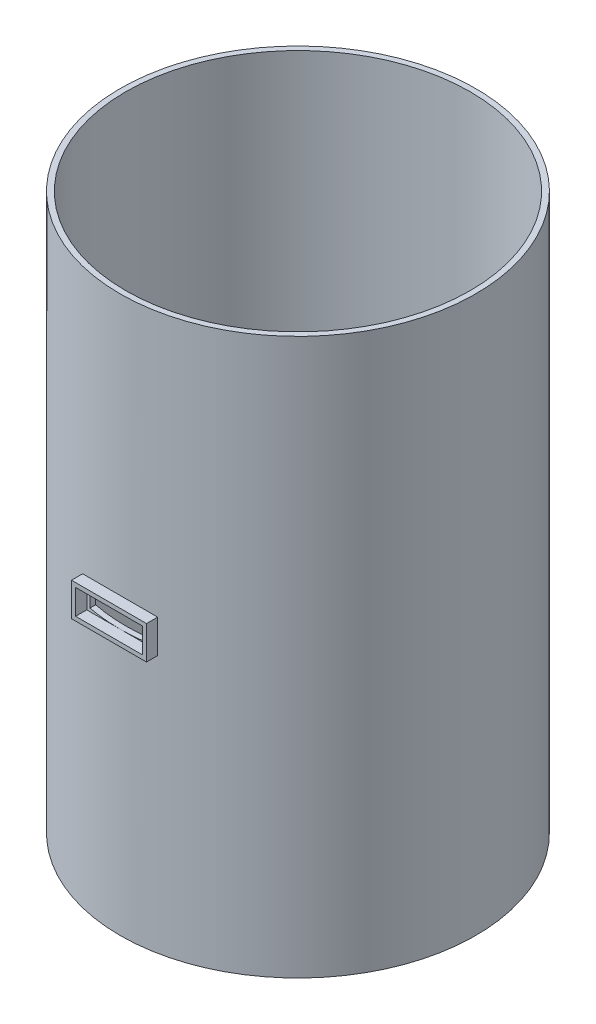
ISO-10303-21;
HEADER;
FILE_DESCRIPTION(('STEP AP214'),'2;1');
FILE_NAME('part.step','',(''),(''),'','','');
FILE_SCHEMA(('AUTOMOTIVE_DESIGN { 1 0 10303 214 1 1 1 1 }'));
ENDSEC;
DATA;
#1=APPLICATION_CONTEXT('core data for automotive mechanical design processes');
#2=APPLICATION_PROTOCOL_DEFINITION('international standard','automotive_design',2000,#1);
#3=PRODUCT_CONTEXT('',#1,'mechanical');
#4=PRODUCT('Part','Part','',(#3));
#5=PRODUCT_RELATED_PRODUCT_CATEGORY('part','',(#4));
#6=PRODUCT_DEFINITION_FORMATION('','',#4);
#7=PRODUCT_DEFINITION_CONTEXT('part definition',#1,'design');
#8=PRODUCT_DEFINITION('design','',#6,#7);
#9=PRODUCT_DEFINITION_SHAPE('','',#8);
#10=(LENGTH_UNIT() NAMED_UNIT(*) SI_UNIT(.MILLI.,.METRE.));
#11=(NAMED_UNIT(*) PLANE_ANGLE_UNIT() SI_UNIT($,.RADIAN.));
#12=(NAMED_UNIT(*) SI_UNIT($,.STERADIAN.) SOLID_ANGLE_UNIT());
#13=UNCERTAINTY_MEASURE_WITH_UNIT(LENGTH_MEASURE(1.E-05),#10,'distance_accuracy_value','');
#14=(GEOMETRIC_REPRESENTATION_CONTEXT(3) GLOBAL_UNCERTAINTY_ASSIGNED_CONTEXT((#13)) GLOBAL_UNIT_ASSIGNED_CONTEXT((#10,
#11,#12)) REPRESENTATION_CONTEXT('',''));
#15=CARTESIAN_POINT('',(0.,0.,0.));
#16=DIRECTION('',(0.,0.,1.));
#17=DIRECTION('',(1.,0.,0.));
#18=AXIS2_PLACEMENT_3D('',#15,#16,#17);
#19=CARTESIAN_POINT('',(0.,0.,34.));
#20=DIRECTION('',(0.,0.,1.));
#21=DIRECTION('',(1.,0.,0.));
#22=AXIS2_PLACEMENT_3D('',#19,#20,#21);
#23=PLANE('',#22);
#24=DIRECTION('',(0.,-1.,0.));
#25=VECTOR('',#24,1.);
#26=CARTESIAN_POINT('',(-6.75000000000002,53.,34.));
#27=LINE('',#26,#25);
#28=CARTESIAN_POINT('',(-6.75000000000002,53.,34.));
#29=VERTEX_POINT('',#28);
#30=CARTESIAN_POINT('',(-6.75000000000002,47.,34.));
#31=VERTEX_POINT('',#30);
#32=EDGE_CURVE('E181',#29,#31,#27,.T.);
#33=ORIENTED_EDGE('',*,*,#32,.T.);
#34=DIRECTION('',(1.,0.,0.));
#35=VECTOR('',#34,1.);
#36=CARTESIAN_POINT('',(-6.75000000000002,47.,34.));
#37=LINE('',#36,#35);
#38=CARTESIAN_POINT('',(6.74999999999998,47.,34.));
#39=VERTEX_POINT('',#38);
#40=EDGE_CURVE('E184',#31,#39,#37,.T.);
#41=ORIENTED_EDGE('',*,*,#40,.T.);
#42=DIRECTION('',(0.,-1.,0.));
#43=VECTOR('',#42,1.);
#44=CARTESIAN_POINT('',(6.74999999999998,53.,34.));
#45=LINE('',#44,#43);
#46=CARTESIAN_POINT('',(6.74999999999998,53.,34.));
#47=VERTEX_POINT('',#46);
#48=EDGE_CURVE('E187',#47,#39,#45,.T.);
#49=ORIENTED_EDGE('',*,*,#48,.F.);
#50=DIRECTION('',(1.,0.,0.));
#51=VECTOR('',#50,1.);
#52=CARTESIAN_POINT('',(-6.75000000000002,53.,34.));
#53=LINE('',#52,#51);
#54=EDGE_CURVE('E190',#29,#47,#53,.T.);
#55=ORIENTED_EDGE('',*,*,#54,.F.);
#56=EDGE_LOOP('',(#33,#41,#49,#55));
#57=FACE_BOUND('',#56,.T.);
#58=DIRECTION('',(1.,0.,0.));
#59=VECTOR('',#58,1.);
#60=CARTESIAN_POINT('',(-6.00000000000001,47.75,34.));
#61=LINE('',#60,#59);
#62=CARTESIAN_POINT('',(-6.00000000000001,47.75,34.));
#63=VERTEX_POINT('',#62);
#64=CARTESIAN_POINT('',(5.99999999999999,47.75,34.));
#65=VERTEX_POINT('',#64);
#66=EDGE_CURVE('E155',#63,#65,#61,.T.);
#67=ORIENTED_EDGE('',*,*,#66,.F.);
#68=DIRECTION('',(0.,-1.,0.));
#69=VECTOR('',#68,1.);
#70=CARTESIAN_POINT('',(-6.00000000000001,52.25,34.));
#71=LINE('',#70,#69);
#72=CARTESIAN_POINT('',(-6.00000000000001,52.25,34.));
#73=VERTEX_POINT('',#72);
#74=EDGE_CURVE('E146',#73,#63,#71,.T.);
#75=ORIENTED_EDGE('',*,*,#74,.F.);
#76=DIRECTION('',(1.,0.,0.));
#77=VECTOR('',#76,1.);
#78=CARTESIAN_POINT('',(-6.00000000000001,52.25,34.));
#79=LINE('',#78,#77);
#80=CARTESIAN_POINT('',(5.99999999999999,52.25,34.));
#81=VERTEX_POINT('',#80);
#82=EDGE_CURVE('E166',#73,#81,#79,.T.);
#83=ORIENTED_EDGE('',*,*,#82,.T.);
#84=DIRECTION('',(0.,-1.,0.));
#85=VECTOR('',#84,1.);
#86=CARTESIAN_POINT('',(5.99999999999999,52.25,34.));
#87=LINE('',#86,#85);
#88=EDGE_CURVE('E96',#81,#65,#87,.T.);
#89=ORIENTED_EDGE('',*,*,#88,.T.);
#90=EDGE_LOOP('',(#67,#75,#83,#89));
#91=FACE_BOUND('',#90,.T.);
#92=ADVANCED_FACE('F81',(#57,#91),#23,.T.);
#93=CARTESIAN_POINT('',(0.,0.,32.));
#94=DIRECTION('',(0.,0.,1.));
#95=DIRECTION('',(1.,0.,0.));
#96=AXIS2_PLACEMENT_3D('',#93,#94,#95);
#97=PLANE('',#96);
#98=DIRECTION('',(0.,-1.,0.));
#99=VECTOR('',#98,1.);
#100=CARTESIAN_POINT('',(-6.75000000000002,53.,32.));
#101=LINE('',#100,#99);
#102=CARTESIAN_POINT('',(-6.75000000000002,53.,32.));
#103=VERTEX_POINT('',#102);
#104=CARTESIAN_POINT('',(-6.75000000000002,47.,32.));
#105=VERTEX_POINT('',#104);
#106=EDGE_CURVE('E162',#103,#105,#101,.T.);
#107=ORIENTED_EDGE('',*,*,#106,.F.);
#108=DIRECTION('',(1.,0.,0.));
#109=VECTOR('',#108,1.);
#110=CARTESIAN_POINT('',(-6.75000000000002,53.,32.));
#111=LINE('',#110,#109);
#112=CARTESIAN_POINT('',(6.74999999999998,53.,32.));
#113=VERTEX_POINT('',#112);
#114=EDGE_CURVE('E185',#103,#113,#111,.T.);
#115=ORIENTED_EDGE('',*,*,#114,.T.);
#116=DIRECTION('',(0.,-1.,0.));
#117=VECTOR('',#116,1.);
#118=CARTESIAN_POINT('',(6.74999999999998,53.,32.));
#119=LINE('',#118,#117);
#120=CARTESIAN_POINT('',(6.74999999999998,47.,32.));
#121=VERTEX_POINT('',#120);
#122=EDGE_CURVE('E199',#113,#121,#119,.T.);
#123=ORIENTED_EDGE('',*,*,#122,.T.);
#124=DIRECTION('',(1.,0.,0.));
#125=VECTOR('',#124,1.);
#126=CARTESIAN_POINT('',(-6.75000000000002,47.,32.));
#127=LINE('',#126,#125);
#128=EDGE_CURVE('E196',#105,#121,#127,.T.);
#129=ORIENTED_EDGE('',*,*,#128,.F.);
#130=EDGE_LOOP('',(#107,#115,#123,#129));
#131=FACE_BOUND('',#130,.T.);
#132=DIRECTION('',(0.,-1.,0.));
#133=VECTOR('',#132,1.);
#134=CARTESIAN_POINT('',(-6.00000000000001,52.25,32.));
#135=LINE('',#134,#133);
#136=CARTESIAN_POINT('',(-6.00000000000001,52.25,32.));
#137=VERTEX_POINT('',#136);
#138=CARTESIAN_POINT('',(-6.00000000000001,47.75,32.));
#139=VERTEX_POINT('',#138);
#140=EDGE_CURVE('E104',#137,#139,#135,.T.);
#141=ORIENTED_EDGE('',*,*,#140,.T.);
#142=DIRECTION('',(1.,0.,0.));
#143=VECTOR('',#142,1.);
#144=CARTESIAN_POINT('',(-6.00000000000001,47.75,32.));
#145=LINE('',#144,#143);
#146=CARTESIAN_POINT('',(5.99999999999999,47.75,32.));
#147=VERTEX_POINT('',#146);
#148=EDGE_CURVE('E161',#139,#147,#145,.T.);
#149=ORIENTED_EDGE('',*,*,#148,.T.);
#150=DIRECTION('',(0.,-1.,0.));
#151=VECTOR('',#150,1.);
#152=CARTESIAN_POINT('',(5.99999999999999,52.25,32.));
#153=LINE('',#152,#151);
#154=CARTESIAN_POINT('',(5.99999999999999,52.25,32.));
#155=VERTEX_POINT('',#154);
#156=EDGE_CURVE('E172',#155,#147,#153,.T.);
#157=ORIENTED_EDGE('',*,*,#156,.F.);
#158=DIRECTION('',(1.,0.,0.));
#159=VECTOR('',#158,1.);
#160=CARTESIAN_POINT('',(-6.00000000000001,52.25,32.));
#161=LINE('',#160,#159);
#162=EDGE_CURVE('E156',#137,#155,#161,.T.);
#163=ORIENTED_EDGE('',*,*,#162,.F.);
#164=EDGE_LOOP('',(#141,#149,#157,#163));
#165=FACE_BOUND('',#164,.T.);
#166=ADVANCED_FACE('F216',(#131,#165),#97,.F.);
#167=CARTESIAN_POINT('',(-6.75000000000002,53.,34.));
#168=DIRECTION('',(1.,0.,0.));
#169=DIRECTION('',(0.,0.,-1.));
#170=AXIS2_PLACEMENT_3D('',#167,#168,#169);
#171=PLANE('',#170);
#172=ORIENTED_EDGE('',*,*,#106,.T.);
#173=DIRECTION('',(0.,0.,-1.));
#174=VECTOR('',#173,1.);
#175=CARTESIAN_POINT('',(-6.75000000000002,47.,34.));
#176=LINE('',#175,#174);
#177=EDGE_CURVE('E13',#31,#105,#176,.T.);
#178=ORIENTED_EDGE('',*,*,#177,.F.);
#179=ORIENTED_EDGE('',*,*,#32,.F.);
#180=DIRECTION('',(0.,0.,-1.));
#181=VECTOR('',#180,1.);
#182=CARTESIAN_POINT('',(-6.75000000000002,53.,34.));
#183=LINE('',#182,#181);
#184=EDGE_CURVE('E193',#29,#103,#183,.T.);
#185=ORIENTED_EDGE('',*,*,#184,.T.);
#186=EDGE_LOOP('',(#172,#178,#179,#185));
#187=FACE_BOUND('',#186,.T.);
#188=ADVANCED_FACE('F83',(#187),#171,.F.);
#189=CARTESIAN_POINT('',(-6.75000000000002,47.,34.));
#190=DIRECTION('',(0.,1.,0.));
#191=DIRECTION('',(0.,0.,1.));
#192=AXIS2_PLACEMENT_3D('',#189,#190,#191);
#193=PLANE('',#192);
#194=ORIENTED_EDGE('',*,*,#128,.T.);
#195=DIRECTION('',(0.,0.,-1.));
#196=VECTOR('',#195,1.);
#197=CARTESIAN_POINT('',(6.74999999999998,47.,34.));
#198=LINE('',#197,#196);
#199=EDGE_CURVE('E89',#39,#121,#198,.T.);
#200=ORIENTED_EDGE('',*,*,#199,.F.);
#201=ORIENTED_EDGE('',*,*,#40,.F.);
#202=ORIENTED_EDGE('',*,*,#177,.T.);
#203=EDGE_LOOP('',(#194,#200,#201,#202));
#204=FACE_BOUND('',#203,.T.);
#205=ADVANCED_FACE('F212',(#204),#193,.F.);
#206=CARTESIAN_POINT('',(6.74999999999998,53.,34.));
#207=DIRECTION('',(1.,0.,0.));
#208=DIRECTION('',(0.,0.,-1.));
#209=AXIS2_PLACEMENT_3D('',#206,#207,#208);
#210=PLANE('',#209);
#211=ORIENTED_EDGE('',*,*,#122,.F.);
#212=DIRECTION('',(0.,0.,-1.));
#213=VECTOR('',#212,1.);
#214=CARTESIAN_POINT('',(6.74999999999998,53.,34.));
#215=LINE('',#214,#213);
#216=EDGE_CURVE('E205',#47,#113,#215,.T.);
#217=ORIENTED_EDGE('',*,*,#216,.F.);
#218=ORIENTED_EDGE('',*,*,#48,.T.);
#219=ORIENTED_EDGE('',*,*,#199,.T.);
#220=EDGE_LOOP('',(#211,#217,#218,#219));
#221=FACE_BOUND('',#220,.T.);
#222=ADVANCED_FACE('F209',(#221),#210,.T.);
#223=CARTESIAN_POINT('',(-6.75000000000002,53.,34.));
#224=DIRECTION('',(0.,1.,0.));
#225=DIRECTION('',(0.,0.,1.));
#226=AXIS2_PLACEMENT_3D('',#223,#224,#225);
#227=PLANE('',#226);
#228=ORIENTED_EDGE('',*,*,#114,.F.);
#229=ORIENTED_EDGE('',*,*,#184,.F.);
#230=ORIENTED_EDGE('',*,*,#54,.T.);
#231=ORIENTED_EDGE('',*,*,#216,.T.);
#232=EDGE_LOOP('',(#228,#229,#230,#231));
#233=FACE_BOUND('',#232,.T.);
#234=ADVANCED_FACE('F220',(#233),#227,.T.);
#235=CARTESIAN_POINT('',(-6.00000000000001,52.25,34.));
#236=DIRECTION('',(1.,0.,0.));
#237=DIRECTION('',(0.,0.,-1.));
#238=AXIS2_PLACEMENT_3D('',#235,#236,#237);
#239=PLANE('',#238);
#240=ORIENTED_EDGE('',*,*,#140,.F.);
#241=DIRECTION('',(0.,0.,-1.));
#242=VECTOR('',#241,1.);
#243=CARTESIAN_POINT('',(-6.00000000000001,52.25,34.));
#244=LINE('',#243,#242);
#245=EDGE_CURVE('E150',#73,#137,#244,.T.);
#246=ORIENTED_EDGE('',*,*,#245,.F.);
#247=ORIENTED_EDGE('',*,*,#74,.T.);
#248=DIRECTION('',(0.,0.,-1.));
#249=VECTOR('',#248,1.);
#250=CARTESIAN_POINT('',(-6.00000000000001,47.75,34.));
#251=LINE('',#250,#249);
#252=EDGE_CURVE('E149',#63,#139,#251,.T.);
#253=ORIENTED_EDGE('',*,*,#252,.T.);
#254=EDGE_LOOP('',(#240,#246,#247,#253));
#255=FACE_BOUND('',#254,.T.);
#256=ADVANCED_FACE('F148',(#255),#239,.T.);
#257=CARTESIAN_POINT('',(-6.00000000000001,47.75,34.));
#258=DIRECTION('',(0.,1.,0.));
#259=DIRECTION('',(0.,0.,1.));
#260=AXIS2_PLACEMENT_3D('',#257,#258,#259);
#261=PLANE('',#260);
#262=ORIENTED_EDGE('',*,*,#148,.F.);
#263=ORIENTED_EDGE('',*,*,#252,.F.);
#264=ORIENTED_EDGE('',*,*,#66,.T.);
#265=DIRECTION('',(0.,0.,-1.));
#266=VECTOR('',#265,1.);
#267=CARTESIAN_POINT('',(5.99999999999999,47.75,34.));
#268=LINE('',#267,#266);
#269=EDGE_CURVE('E163',#65,#147,#268,.T.);
#270=ORIENTED_EDGE('',*,*,#269,.T.);
#271=EDGE_LOOP('',(#262,#263,#264,#270));
#272=FACE_BOUND('',#271,.T.);
#273=ADVANCED_FACE('F159',(#272),#261,.T.);
#274=CARTESIAN_POINT('',(5.99999999999999,52.25,34.));
#275=DIRECTION('',(1.,0.,0.));
#276=DIRECTION('',(0.,1.,0.));
#277=AXIS2_PLACEMENT_3D('',#274,#275,#276);
#278=PLANE('',#277);
#279=ORIENTED_EDGE('',*,*,#156,.T.);
#280=ORIENTED_EDGE('',*,*,#269,.F.);
#281=ORIENTED_EDGE('',*,*,#88,.F.);
#282=DIRECTION('',(0.,0.,-1.));
#283=VECTOR('',#282,1.);
#284=CARTESIAN_POINT('',(5.99999999999999,52.25,34.));
#285=LINE('',#284,#283);
#286=EDGE_CURVE('E178',#81,#155,#285,.T.);
#287=ORIENTED_EDGE('',*,*,#286,.T.);
#288=EDGE_LOOP('',(#279,#280,#281,#287));
#289=FACE_BOUND('',#288,.T.);
#290=ADVANCED_FACE('F261',(#289),#278,.F.);
#291=CARTESIAN_POINT('',(-6.00000000000001,52.25,34.));
#292=DIRECTION('',(0.,1.,0.));
#293=DIRECTION('',(0.,0.,1.));
#294=AXIS2_PLACEMENT_3D('',#291,#292,#293);
#295=PLANE('',#294);
#296=ORIENTED_EDGE('',*,*,#162,.T.);
#297=ORIENTED_EDGE('',*,*,#286,.F.);
#298=ORIENTED_EDGE('',*,*,#82,.F.);
#299=ORIENTED_EDGE('',*,*,#245,.T.);
#300=EDGE_LOOP('',(#296,#297,#298,#299));
#301=FACE_BOUND('',#300,.T.);
#302=ADVANCED_FACE('F267',(#301),#295,.F.);
#303=CLOSED_SHELL('',(#92,#166,#188,#205,#222,#234,#256,#273,#290,#302));
#304=MANIFOLD_SOLID_BREP('B2',#303);
#305=CARTESIAN_POINT('',(0.,100.,0.));
#306=DIRECTION('',(0.,-1.,0.));
#307=DIRECTION('',(0.,0.,-1.));
#308=AXIS2_PLACEMENT_3D('',#305,#306,#307);
#309=CYLINDRICAL_SURFACE('',#308,32.);
#310=CARTESIAN_POINT('',(0.,0.,0.));
#311=DIRECTION('',(0.,1.,0.));
#312=DIRECTION('',(0.,0.,1.));
#313=AXIS2_PLACEMENT_3D('',#310,#311,#312);
#314=CIRCLE('',#313,32.);
#315=CARTESIAN_POINT('',(0.,0.,32.));
#316=VERTEX_POINT('',#315);
#317=EDGE_CURVE('E391',#316,#316,#314,.T.);
#318=ORIENTED_EDGE('',*,*,#317,.T.);
#319=EDGE_LOOP('',(#318));
#320=FACE_BOUND('',#319,.T.);
#321=CARTESIAN_POINT('',(0.,100.,0.));
#322=DIRECTION('',(0.,1.,0.));
#323=DIRECTION('',(0.,0.,1.));
#324=AXIS2_PLACEMENT_3D('',#321,#322,#323);
#325=CIRCLE('',#324,32.);
#326=CARTESIAN_POINT('',(0.,100.,32.));
#327=VERTEX_POINT('',#326);
#328=EDGE_CURVE('E373',#327,#327,#325,.T.);
#329=ORIENTED_EDGE('',*,*,#328,.F.);
#330=EDGE_LOOP('',(#329));
#331=FACE_BOUND('',#330,.T.);
#332=DIRECTION('',(0.,-1.,0.));
#333=VECTOR('',#332,1.);
#334=CARTESIAN_POINT('',(5.99999999999999,100.,31.4324672910034));
#335=LINE('',#334,#333);
#336=CARTESIAN_POINT('',(5.99999999999999,47.75,31.4324672910034));
#337=VERTEX_POINT('',#336);
#338=CARTESIAN_POINT('',(5.99999999999999,52.25,31.4324672910034));
#339=VERTEX_POINT('',#338);
#340=EDGE_CURVE('E403',#337,#339,#335,.F.);
#341=ORIENTED_EDGE('',*,*,#340,.F.);
#342=CARTESIAN_POINT('',(0.,47.75,0.));
#343=DIRECTION('',(0.,1.,0.));
#344=DIRECTION('',(0.,0.,1.));
#345=AXIS2_PLACEMENT_3D('',#342,#343,#344);
#346=CIRCLE('',#345,32.);
#347=CARTESIAN_POINT('',(-5.99999999999999,47.75,31.4324672910034));
#348=VERTEX_POINT('',#347);
#349=EDGE_CURVE('E414',#348,#337,#346,.T.);
#350=ORIENTED_EDGE('',*,*,#349,.F.);
#351=DIRECTION('',(0.,-1.,0.));
#352=VECTOR('',#351,1.);
#353=CARTESIAN_POINT('',(-5.99999999999999,100.,31.4324672910034));
#354=LINE('',#353,#352);
#355=CARTESIAN_POINT('',(-5.99999999999999,52.25,31.4324672910034));
#356=VERTEX_POINT('',#355);
#357=EDGE_CURVE('E380',#356,#348,#354,.T.);
#358=ORIENTED_EDGE('',*,*,#357,.F.);
#359=CARTESIAN_POINT('',(0.,52.25,0.));
#360=DIRECTION('',(0.,-1.,0.));
#361=DIRECTION('',(0.,0.,-1.));
#362=AXIS2_PLACEMENT_3D('',#359,#360,#361);
#363=CIRCLE('',#362,32.);
#364=EDGE_CURVE('E409',#339,#356,#363,.T.);
#365=ORIENTED_EDGE('',*,*,#364,.F.);
#366=EDGE_LOOP('',(#341,#350,#358,#365));
#367=FACE_BOUND('',#366,.T.);
#368=ADVANCED_FACE('F329',(#320,#331,#367),#309,.T.);
#369=CARTESIAN_POINT('',(0.,100.,0.));
#370=DIRECTION('',(0.,-1.,0.));
#371=DIRECTION('',(0.,0.,-1.));
#372=AXIS2_PLACEMENT_3D('',#369,#370,#371);
#373=CYLINDRICAL_SURFACE('',#372,31.);
#374=CARTESIAN_POINT('',(0.,100.,0.));
#375=DIRECTION('',(0.,1.,0.));
#376=DIRECTION('',(0.,0.,1.));
#377=AXIS2_PLACEMENT_3D('',#374,#375,#376);
#378=CIRCLE('',#377,31.);
#379=CARTESIAN_POINT('',(0.,100.,31.));
#380=VERTEX_POINT('',#379);
#381=EDGE_CURVE('E395',#380,#380,#378,.T.);
#382=ORIENTED_EDGE('',*,*,#381,.T.);
#383=EDGE_LOOP('',(#382));
#384=FACE_BOUND('',#383,.T.);
#385=CARTESIAN_POINT('',(0.,0.,0.));
#386=DIRECTION('',(0.,1.,0.));
#387=DIRECTION('',(0.,0.,1.));
#388=AXIS2_PLACEMENT_3D('',#385,#386,#387);
#389=CIRCLE('',#388,31.);
#390=CARTESIAN_POINT('',(0.,0.,31.));
#391=VERTEX_POINT('',#390);
#392=EDGE_CURVE('E399',#391,#391,#389,.T.);
#393=ORIENTED_EDGE('',*,*,#392,.F.);
#394=EDGE_LOOP('',(#393));
#395=FACE_BOUND('',#394,.T.);
#396=CARTESIAN_POINT('',(0.,47.75,0.));
#397=DIRECTION('',(0.,1.,0.));
#398=DIRECTION('',(0.,0.,1.));
#399=AXIS2_PLACEMENT_3D('',#396,#397,#398);
#400=CIRCLE('',#399,31.);
#401=CARTESIAN_POINT('',(-5.99999999999999,47.75,30.4138126514911));
#402=VERTEX_POINT('',#401);
#403=CARTESIAN_POINT('',(5.99999999999999,47.75,30.4138126514911));
#404=VERTEX_POINT('',#403);
#405=EDGE_CURVE('E367',#402,#404,#400,.T.);
#406=ORIENTED_EDGE('',*,*,#405,.T.);
#407=DIRECTION('',(0.,-1.,0.));
#408=VECTOR('',#407,1.);
#409=CARTESIAN_POINT('',(5.99999999999999,100.,30.4138126514911));
#410=LINE('',#409,#408);
#411=CARTESIAN_POINT('',(5.99999999999999,52.25,30.4138126514911));
#412=VERTEX_POINT('',#411);
#413=EDGE_CURVE('E79',#404,#412,#410,.F.);
#414=ORIENTED_EDGE('',*,*,#413,.T.);
#415=CARTESIAN_POINT('',(0.,52.25,0.));
#416=DIRECTION('',(0.,-1.,0.));
#417=DIRECTION('',(0.,0.,-1.));
#418=AXIS2_PLACEMENT_3D('',#415,#416,#417);
#419=CIRCLE('',#418,31.);
#420=CARTESIAN_POINT('',(-5.99999999999999,52.25,30.4138126514911));
#421=VERTEX_POINT('',#420);
#422=EDGE_CURVE('E337',#412,#421,#419,.T.);
#423=ORIENTED_EDGE('',*,*,#422,.T.);
#424=DIRECTION('',(0.,-1.,0.));
#425=VECTOR('',#424,1.);
#426=CARTESIAN_POINT('',(-5.99999999999999,100.,30.4138126514911));
#427=LINE('',#426,#425);
#428=EDGE_CURVE('E372',#421,#402,#427,.T.);
#429=ORIENTED_EDGE('',*,*,#428,.T.);
#430=EDGE_LOOP('',(#406,#414,#423,#429));
#431=FACE_BOUND('',#430,.T.);
#432=ADVANCED_FACE('F386',(#384,#395,#431),#373,.F.);
#433=CARTESIAN_POINT('',(0.,100.,0.));
#434=DIRECTION('',(0.,1.,0.));
#435=DIRECTION('',(0.,0.,1.));
#436=AXIS2_PLACEMENT_3D('',#433,#434,#435);
#437=PLANE('',#436);
#438=ORIENTED_EDGE('',*,*,#328,.T.);
#439=EDGE_LOOP('',(#438));
#440=FACE_BOUND('',#439,.T.);
#441=ORIENTED_EDGE('',*,*,#381,.F.);
#442=EDGE_LOOP('',(#441));
#443=FACE_BOUND('',#442,.T.);
#444=ADVANCED_FACE('F441',(#440,#443),#437,.T.);
#445=CARTESIAN_POINT('',(0.,0.,0.));
#446=DIRECTION('',(0.,1.,0.));
#447=DIRECTION('',(0.,0.,1.));
#448=AXIS2_PLACEMENT_3D('',#445,#446,#447);
#449=PLANE('',#448);
#450=ORIENTED_EDGE('',*,*,#317,.F.);
#451=EDGE_LOOP('',(#450));
#452=FACE_BOUND('',#451,.T.);
#453=ORIENTED_EDGE('',*,*,#392,.T.);
#454=EDGE_LOOP('',(#453));
#455=FACE_BOUND('',#454,.T.);
#456=ADVANCED_FACE('F433',(#452,#455),#449,.F.);
#457=CARTESIAN_POINT('',(5.99999999999999,52.25,34.));
#458=DIRECTION('',(-1.,0.,0.));
#459=DIRECTION('',(0.,0.,1.));
#460=AXIS2_PLACEMENT_3D('',#457,#458,#459);
#461=PLANE('',#460);
#462=ORIENTED_EDGE('',*,*,#340,.T.);
#463=DIRECTION('',(0.,0.,-1.));
#464=VECTOR('',#463,1.);
#465=CARTESIAN_POINT('',(5.99999999999999,52.25,34.));
#466=LINE('',#465,#464);
#467=EDGE_CURVE('E417',#339,#412,#466,.T.);
#468=ORIENTED_EDGE('',*,*,#467,.T.);
#469=ORIENTED_EDGE('',*,*,#413,.F.);
#470=DIRECTION('',(0.,0.,-1.));
#471=VECTOR('',#470,1.);
#472=CARTESIAN_POINT('',(5.99999999999999,47.75,34.));
#473=LINE('',#472,#471);
#474=EDGE_CURVE('E349',#337,#404,#473,.T.);
#475=ORIENTED_EDGE('',*,*,#474,.F.);
#476=EDGE_LOOP('',(#462,#468,#469,#475));
#477=FACE_BOUND('',#476,.T.);
#478=ADVANCED_FACE('F431',(#477),#461,.T.);
#479=CARTESIAN_POINT('',(-5.99999999999999,52.25,34.));
#480=DIRECTION('',(0.,-1.,0.));
#481=DIRECTION('',(0.,0.,-1.));
#482=AXIS2_PLACEMENT_3D('',#479,#480,#481);
#483=PLANE('',#482);
#484=ORIENTED_EDGE('',*,*,#364,.T.);
#485=DIRECTION('',(0.,0.,-1.));
#486=VECTOR('',#485,1.);
#487=CARTESIAN_POINT('',(-5.99999999999999,52.25,34.));
#488=LINE('',#487,#486);
#489=EDGE_CURVE('E383',#356,#421,#488,.T.);
#490=ORIENTED_EDGE('',*,*,#489,.T.);
#491=ORIENTED_EDGE('',*,*,#422,.F.);
#492=ORIENTED_EDGE('',*,*,#467,.F.);
#493=EDGE_LOOP('',(#484,#490,#491,#492));
#494=FACE_BOUND('',#493,.T.);
#495=ADVANCED_FACE('F425',(#494),#483,.T.);
#496=CARTESIAN_POINT('',(-5.99999999999999,52.25,34.));
#497=DIRECTION('',(1.,0.,0.));
#498=DIRECTION('',(0.,0.,-1.));
#499=AXIS2_PLACEMENT_3D('',#496,#497,#498);
#500=PLANE('',#499);
#501=ORIENTED_EDGE('',*,*,#357,.T.);
#502=DIRECTION('',(0.,0.,-1.));
#503=VECTOR('',#502,1.);
#504=CARTESIAN_POINT('',(-5.99999999999999,47.75,34.));
#505=LINE('',#504,#503);
#506=EDGE_CURVE('E344',#348,#402,#505,.T.);
#507=ORIENTED_EDGE('',*,*,#506,.T.);
#508=ORIENTED_EDGE('',*,*,#428,.F.);
#509=ORIENTED_EDGE('',*,*,#489,.F.);
#510=EDGE_LOOP('',(#501,#507,#508,#509));
#511=FACE_BOUND('',#510,.T.);
#512=ADVANCED_FACE('F376',(#511),#500,.T.);
#513=CARTESIAN_POINT('',(-5.99999999999999,47.75,34.));
#514=DIRECTION('',(0.,1.,0.));
#515=DIRECTION('',(0.,0.,1.));
#516=AXIS2_PLACEMENT_3D('',#513,#514,#515);
#517=PLANE('',#516);
#518=ORIENTED_EDGE('',*,*,#349,.T.);
#519=ORIENTED_EDGE('',*,*,#474,.T.);
#520=ORIENTED_EDGE('',*,*,#405,.F.);
#521=ORIENTED_EDGE('',*,*,#506,.F.);
#522=EDGE_LOOP('',(#518,#519,#520,#521));
#523=FACE_BOUND('',#522,.T.);
#524=ADVANCED_FACE('F368',(#523),#517,.T.);
#525=CLOSED_SHELL('',(#368,#432,#444,#456,#478,#495,#512,#524));
#526=MANIFOLD_SOLID_BREP('B7',#525);
#527=ADVANCED_BREP_SHAPE_REPRESENTATION('',(#18,#304,#526),#14);
#528=SHAPE_DEFINITION_REPRESENTATION(#9,#527);
ENDSEC;
END-ISO-10303-21;
